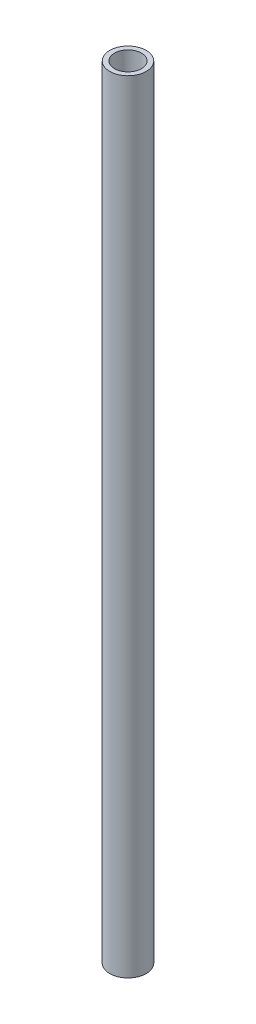
ISO-10303-21;
HEADER;
FILE_DESCRIPTION(('STEP AP214'),'2;1');
FILE_NAME('part.step','',(''),(''),'','','');
FILE_SCHEMA(('AUTOMOTIVE_DESIGN { 1 0 10303 214 1 1 1 1 }'));
ENDSEC;
DATA;
#1=APPLICATION_CONTEXT('core data for automotive mechanical design processes');
#2=APPLICATION_PROTOCOL_DEFINITION('international standard','automotive_design',2000,#1);
#3=PRODUCT_CONTEXT('',#1,'mechanical');
#4=PRODUCT('Part','Part','',(#3));
#5=PRODUCT_RELATED_PRODUCT_CATEGORY('part','',(#4));
#6=PRODUCT_DEFINITION_FORMATION('','',#4);
#7=PRODUCT_DEFINITION_CONTEXT('part definition',#1,'design');
#8=PRODUCT_DEFINITION('design','',#6,#7);
#9=PRODUCT_DEFINITION_SHAPE('','',#8);
#10=(LENGTH_UNIT() NAMED_UNIT(*) SI_UNIT(.MILLI.,.METRE.));
#11=(NAMED_UNIT(*) PLANE_ANGLE_UNIT() SI_UNIT($,.RADIAN.));
#12=(NAMED_UNIT(*) SI_UNIT($,.STERADIAN.) SOLID_ANGLE_UNIT());
#13=UNCERTAINTY_MEASURE_WITH_UNIT(LENGTH_MEASURE(1.E-05),#10,'distance_accuracy_value','');
#14=(GEOMETRIC_REPRESENTATION_CONTEXT(3) GLOBAL_UNCERTAINTY_ASSIGNED_CONTEXT((#13)) GLOBAL_UNIT_ASSIGNED_CONTEXT((#10,
#11,#12)) REPRESENTATION_CONTEXT('',''));
#15=CARTESIAN_POINT('',(0.,0.,0.));
#16=DIRECTION('',(0.,0.,1.));
#17=DIRECTION('',(1.,0.,0.));
#18=AXIS2_PLACEMENT_3D('',#15,#16,#17);
#19=CARTESIAN_POINT('',(0.,457.2,0.));
#20=DIRECTION('',(0.,1.,0.));
#21=DIRECTION('',(0.,0.,1.));
#22=AXIS2_PLACEMENT_3D('',#19,#20,#21);
#23=PLANE('',#22);
#24=CARTESIAN_POINT('',(0.,457.2,0.));
#25=DIRECTION('',(0.,1.,0.));
#26=DIRECTION('',(0.,0.,1.));
#27=AXIS2_PLACEMENT_3D('',#24,#25,#26);
#28=CIRCLE('',#27,10.668);
#29=CARTESIAN_POINT('',(0.,457.2,10.668));
#30=VERTEX_POINT('',#29);
#31=EDGE_CURVE('E10',#30,#30,#28,.T.);
#32=ORIENTED_EDGE('',*,*,#31,.T.);
#33=EDGE_LOOP('',(#32));
#34=FACE_BOUND('',#33,.T.);
#35=CARTESIAN_POINT('',(0.,457.2,0.));
#36=DIRECTION('',(0.,1.,0.));
#37=DIRECTION('',(0.,0.,1.));
#38=AXIS2_PLACEMENT_3D('',#35,#36,#37);
#39=CIRCLE('',#38,7.8994);
#40=CARTESIAN_POINT('',(0.,457.2,7.8994));
#41=VERTEX_POINT('',#40);
#42=EDGE_CURVE('E43',#41,#41,#39,.T.);
#43=ORIENTED_EDGE('',*,*,#42,.F.);
#44=EDGE_LOOP('',(#43));
#45=FACE_BOUND('',#44,.T.);
#46=ADVANCED_FACE('F32',(#34,#45),#23,.T.);
#47=CARTESIAN_POINT('',(0.,0.,0.));
#48=DIRECTION('',(0.,1.,0.));
#49=DIRECTION('',(0.,0.,1.));
#50=AXIS2_PLACEMENT_3D('',#47,#48,#49);
#51=PLANE('',#50);
#52=CARTESIAN_POINT('',(0.,0.,0.));
#53=DIRECTION('',(0.,1.,0.));
#54=DIRECTION('',(0.,0.,1.));
#55=AXIS2_PLACEMENT_3D('',#52,#53,#54);
#56=CIRCLE('',#55,10.668);
#57=CARTESIAN_POINT('',(0.,0.,10.668));
#58=VERTEX_POINT('',#57);
#59=EDGE_CURVE('E36',#58,#58,#56,.T.);
#60=ORIENTED_EDGE('',*,*,#59,.F.);
#61=EDGE_LOOP('',(#60));
#62=FACE_BOUND('',#61,.T.);
#63=CARTESIAN_POINT('',(0.,0.,0.));
#64=DIRECTION('',(0.,1.,0.));
#65=DIRECTION('',(0.,0.,1.));
#66=AXIS2_PLACEMENT_3D('',#63,#64,#65);
#67=CIRCLE('',#66,7.8994);
#68=CARTESIAN_POINT('',(0.,0.,7.8994));
#69=VERTEX_POINT('',#68);
#70=EDGE_CURVE('E45',#69,#69,#67,.T.);
#71=ORIENTED_EDGE('',*,*,#70,.T.);
#72=EDGE_LOOP('',(#71));
#73=FACE_BOUND('',#72,.T.);
#74=ADVANCED_FACE('F55',(#62,#73),#51,.F.);
#75=CARTESIAN_POINT('',(0.,457.2,0.));
#76=DIRECTION('',(0.,-1.,0.));
#77=DIRECTION('',(0.,0.,-1.));
#78=AXIS2_PLACEMENT_3D('',#75,#76,#77);
#79=CYLINDRICAL_SURFACE('',#78,10.668);
#80=ORIENTED_EDGE('',*,*,#31,.F.);
#81=EDGE_LOOP('',(#80));
#82=FACE_BOUND('',#81,.T.);
#83=ORIENTED_EDGE('',*,*,#59,.T.);
#84=EDGE_LOOP('',(#83));
#85=FACE_BOUND('',#84,.T.);
#86=ADVANCED_FACE('F34',(#82,#85),#79,.T.);
#87=CARTESIAN_POINT('',(0.,457.2,0.));
#88=DIRECTION('',(0.,-1.,0.));
#89=DIRECTION('',(0.,0.,-1.));
#90=AXIS2_PLACEMENT_3D('',#87,#88,#89);
#91=CYLINDRICAL_SURFACE('',#90,7.8994);
#92=ORIENTED_EDGE('',*,*,#42,.T.);
#93=EDGE_LOOP('',(#92));
#94=FACE_BOUND('',#93,.T.);
#95=ORIENTED_EDGE('',*,*,#70,.F.);
#96=EDGE_LOOP('',(#95));
#97=FACE_BOUND('',#96,.T.);
#98=ADVANCED_FACE('F51',(#94,#97),#91,.F.);
#99=CLOSED_SHELL('',(#46,#74,#86,#98));
#100=MANIFOLD_SOLID_BREP('B2',#99);
#101=ADVANCED_BREP_SHAPE_REPRESENTATION('',(#18,#100),#14);
#102=SHAPE_DEFINITION_REPRESENTATION(#9,#101);
ENDSEC;
END-ISO-10303-21;
